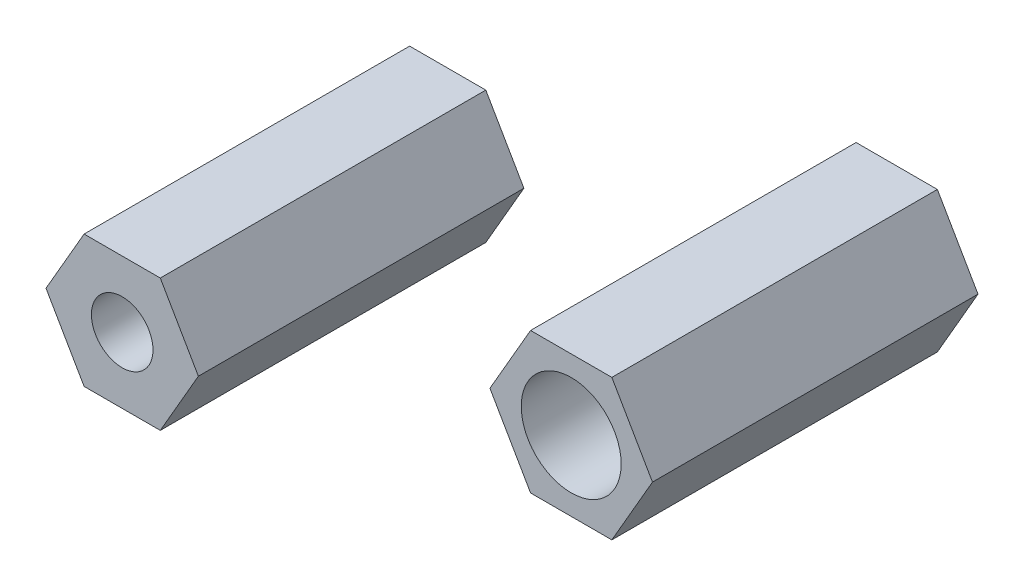
ISO-10303-21;
HEADER;
FILE_DESCRIPTION(('STEP AP214'),'2;1');
FILE_NAME('part.step','',(''),(''),'','','');
FILE_SCHEMA(('AUTOMOTIVE_DESIGN { 1 0 10303 214 1 1 1 1 }'));
ENDSEC;
DATA;
#1=APPLICATION_CONTEXT('core data for automotive mechanical design processes');
#2=APPLICATION_PROTOCOL_DEFINITION('international standard','automotive_design',2000,#1);
#3=PRODUCT_CONTEXT('',#1,'mechanical');
#4=PRODUCT('Part','Part','',(#3));
#5=PRODUCT_RELATED_PRODUCT_CATEGORY('part','',(#4));
#6=PRODUCT_DEFINITION_FORMATION('','',#4);
#7=PRODUCT_DEFINITION_CONTEXT('part definition',#1,'design');
#8=PRODUCT_DEFINITION('design','',#6,#7);
#9=PRODUCT_DEFINITION_SHAPE('','',#8);
#10=(LENGTH_UNIT() NAMED_UNIT(*) SI_UNIT(.MILLI.,.METRE.));
#11=(NAMED_UNIT(*) PLANE_ANGLE_UNIT() SI_UNIT($,.RADIAN.));
#12=(NAMED_UNIT(*) SI_UNIT($,.STERADIAN.) SOLID_ANGLE_UNIT());
#13=UNCERTAINTY_MEASURE_WITH_UNIT(LENGTH_MEASURE(1.E-05),#10,'distance_accuracy_value','');
#14=(GEOMETRIC_REPRESENTATION_CONTEXT(3) GLOBAL_UNCERTAINTY_ASSIGNED_CONTEXT((#13)) GLOBAL_UNIT_ASSIGNED_CONTEXT((#10,
#11,#12)) REPRESENTATION_CONTEXT('',''));
#15=CARTESIAN_POINT('',(0.,0.,0.));
#16=DIRECTION('',(0.,0.,1.));
#17=DIRECTION('',(1.,0.,0.));
#18=AXIS2_PLACEMENT_3D('',#15,#16,#17);
#19=CARTESIAN_POINT('',(-31.5035478936676,4.14888144856973,23.5330204590227));
#20=DIRECTION('',(0.,0.,1.));
#21=DIRECTION('',(1.,0.,0.));
#22=AXIS2_PLACEMENT_3D('',#19,#20,#21);
#23=PLANE('',#22);
#24=CARTESIAN_POINT('',(-31.5035478936676,4.14888144856973,23.5330204590227));
#25=DIRECTION('',(0.,0.,1.));
#26=DIRECTION('',(1.,0.,0.));
#27=AXIS2_PLACEMENT_3D('',#24,#25,#26);
#28=CIRCLE('',#27,3.5);
#29=CARTESIAN_POINT('',(-28.0035478936676,4.14888144856973,23.5330204590227));
#30=VERTEX_POINT('',#29);
#31=EDGE_CURVE('E12',#30,#30,#28,.F.);
#32=ORIENTED_EDGE('',*,*,#31,.F.);
#33=EDGE_LOOP('',(#32));
#34=FACE_BOUND('',#33,.T.);
#35=CARTESIAN_POINT('',(-31.5035478936676,4.14888144856973,23.5330204590227));
#36=DIRECTION('',(0.,0.,1.));
#37=DIRECTION('',(1.,0.,0.));
#38=AXIS2_PLACEMENT_3D('',#35,#36,#37);
#39=CIRCLE('',#38,2.4);
#40=CARTESIAN_POINT('',(-29.1035478936676,4.14888144856973,23.5330204590227));
#41=VERTEX_POINT('',#40);
#42=EDGE_CURVE('E135',#41,#41,#39,.T.);
#43=ORIENTED_EDGE('',*,*,#42,.F.);
#44=EDGE_LOOP('',(#43));
#45=FACE_BOUND('',#44,.T.);
#46=ADVANCED_FACE('F44',(#34,#45),#23,.T.);
#47=CARTESIAN_POINT('',(-31.5035478936676,4.14888144856973,19.5330204590227));
#48=DIRECTION('',(0.,0.,1.));
#49=DIRECTION('',(1.,0.,0.));
#50=AXIS2_PLACEMENT_3D('',#47,#48,#49);
#51=PLANE('',#50);
#52=DIRECTION('',(-0.5,-0.866025403784439,0.));
#53=VECTOR('',#52,1.);
#54=CARTESIAN_POINT('',(-35.8336749125898,11.6488814485697,19.5330204590227));
#55=LINE('',#54,#53);
#56=CARTESIAN_POINT('',(-35.8336749125898,11.6488814485697,19.5330204590227));
#57=VERTEX_POINT('',#56);
#58=CARTESIAN_POINT('',(-40.163801931512,4.14888144856973,19.5330204590227));
#59=VERTEX_POINT('',#58);
#60=EDGE_CURVE('E138',#57,#59,#55,.T.);
#61=ORIENTED_EDGE('',*,*,#60,.F.);
#62=DIRECTION('',(-1.,0.,0.));
#63=VECTOR('',#62,1.);
#64=CARTESIAN_POINT('',(-27.1734208747454,11.6488814485697,19.5330204590227));
#65=LINE('',#64,#63);
#66=CARTESIAN_POINT('',(-27.1734208747454,11.6488814485697,19.5330204590227));
#67=VERTEX_POINT('',#66);
#68=EDGE_CURVE('E59',#67,#57,#65,.T.);
#69=ORIENTED_EDGE('',*,*,#68,.F.);
#70=DIRECTION('',(-0.5,0.866025403784439,0.));
#71=VECTOR('',#70,1.);
#72=CARTESIAN_POINT('',(-22.8432938558232,4.14888144856974,19.5330204590227));
#73=LINE('',#72,#71);
#74=CARTESIAN_POINT('',(-22.8432938558232,4.14888144856974,19.5330204590227));
#75=VERTEX_POINT('',#74);
#76=EDGE_CURVE('E67',#75,#67,#73,.T.);
#77=ORIENTED_EDGE('',*,*,#76,.F.);
#78=DIRECTION('',(0.5,0.866025403784439,0.));
#79=VECTOR('',#78,1.);
#80=CARTESIAN_POINT('',(-27.1734208747454,-3.35111855143027,19.5330204590227));
#81=LINE('',#80,#79);
#82=CARTESIAN_POINT('',(-27.1734208747454,-3.35111855143027,19.5330204590227));
#83=VERTEX_POINT('',#82);
#84=EDGE_CURVE('E104',#83,#75,#81,.T.);
#85=ORIENTED_EDGE('',*,*,#84,.F.);
#86=DIRECTION('',(1.,0.,0.));
#87=VECTOR('',#86,1.);
#88=CARTESIAN_POINT('',(-35.8336749125898,-3.35111855143027,19.5330204590227));
#89=LINE('',#88,#87);
#90=CARTESIAN_POINT('',(-35.8336749125898,-3.35111855143027,19.5330204590227));
#91=VERTEX_POINT('',#90);
#92=EDGE_CURVE('E145',#91,#83,#89,.T.);
#93=ORIENTED_EDGE('',*,*,#92,.F.);
#94=DIRECTION('',(0.5,-0.866025403784439,0.));
#95=VECTOR('',#94,1.);
#96=CARTESIAN_POINT('',(-40.163801931512,4.14888144856973,19.5330204590227));
#97=LINE('',#96,#95);
#98=EDGE_CURVE('E143',#59,#91,#97,.T.);
#99=ORIENTED_EDGE('',*,*,#98,.F.);
#100=EDGE_LOOP('',(#61,#69,#77,#85,#93,#99));
#101=FACE_BOUND('',#100,.T.);
#102=CARTESIAN_POINT('',(-31.5035478936676,4.14888144856973,19.5330204590227));
#103=DIRECTION('',(0.,0.,1.));
#104=DIRECTION('',(1.,0.,0.));
#105=AXIS2_PLACEMENT_3D('',#102,#103,#104);
#106=CIRCLE('',#105,2.4);
#107=CARTESIAN_POINT('',(-29.1035478936676,4.14888144856973,19.5330204590227));
#108=VERTEX_POINT('',#107);
#109=EDGE_CURVE('E134',#108,#108,#106,.T.);
#110=ORIENTED_EDGE('',*,*,#109,.T.);
#111=EDGE_LOOP('',(#110));
#112=FACE_BOUND('',#111,.T.);
#113=ADVANCED_FACE('F164',(#101,#112),#51,.F.);
#114=CARTESIAN_POINT('',(-35.8336749125898,11.6488814485697,23.5330204590227));
#115=DIRECTION('',(0.866025403784439,-0.5,0.));
#116=DIRECTION('',(0.5,0.866025403784439,0.));
#117=AXIS2_PLACEMENT_3D('',#114,#115,#116);
#118=PLANE('',#117);
#119=ORIENTED_EDGE('',*,*,#60,.T.);
#120=DIRECTION('',(0.,0.,-1.));
#121=VECTOR('',#120,1.);
#122=CARTESIAN_POINT('',(-40.163801931512,4.14888144856973,23.5330204590227));
#123=LINE('',#122,#121);
#124=CARTESIAN_POINT('',(-40.163801931512,4.14888144856967,56.5330204590227));
#125=VERTEX_POINT('',#124);
#126=EDGE_CURVE('E52',#125,#59,#123,.T.);
#127=ORIENTED_EDGE('',*,*,#126,.F.);
#128=DIRECTION('',(-0.499999999999995,-0.866025403784442,0.));
#129=VECTOR('',#128,1.);
#130=CARTESIAN_POINT('',(-35.8336749125898,11.6488814485697,56.5330204590227));
#131=LINE('',#130,#129);
#132=CARTESIAN_POINT('',(-35.8336749125898,11.6488814485697,56.5330204590227));
#133=VERTEX_POINT('',#132);
#134=EDGE_CURVE('E128',#133,#125,#131,.T.);
#135=ORIENTED_EDGE('',*,*,#134,.F.);
#136=DIRECTION('',(0.,0.,-1.));
#137=VECTOR('',#136,1.);
#138=CARTESIAN_POINT('',(-35.8336749125898,11.6488814485697,23.5330204590227));
#139=LINE('',#138,#137);
#140=EDGE_CURVE('E150',#133,#57,#139,.T.);
#141=ORIENTED_EDGE('',*,*,#140,.T.);
#142=EDGE_LOOP('',(#119,#127,#135,#141));
#143=FACE_BOUND('',#142,.T.);
#144=ADVANCED_FACE('F46',(#143),#118,.F.);
#145=CARTESIAN_POINT('',(-40.163801931512,4.14888144856973,23.5330204590227));
#146=DIRECTION('',(0.866025403784439,0.5,0.));
#147=DIRECTION('',(-0.5,0.866025403784439,0.));
#148=AXIS2_PLACEMENT_3D('',#145,#146,#147);
#149=PLANE('',#148);
#150=ORIENTED_EDGE('',*,*,#98,.T.);
#151=DIRECTION('',(0.,0.,-1.));
#152=VECTOR('',#151,1.);
#153=CARTESIAN_POINT('',(-35.8336749125898,-3.35111855143027,23.5330204590227));
#154=LINE('',#153,#152);
#155=CARTESIAN_POINT('',(-35.8336749125897,-3.35111855143031,56.5330204590227));
#156=VERTEX_POINT('',#155);
#157=EDGE_CURVE('E154',#156,#91,#154,.T.);
#158=ORIENTED_EDGE('',*,*,#157,.F.);
#159=DIRECTION('',(0.500000000000007,-0.866025403784434,0.));
#160=VECTOR('',#159,1.);
#161=CARTESIAN_POINT('',(-40.163801931512,4.14888144856967,56.5330204590227));
#162=LINE('',#161,#160);
#163=EDGE_CURVE('E131',#125,#156,#162,.T.);
#164=ORIENTED_EDGE('',*,*,#163,.F.);
#165=ORIENTED_EDGE('',*,*,#126,.T.);
#166=EDGE_LOOP('',(#150,#158,#164,#165));
#167=FACE_BOUND('',#166,.T.);
#168=ADVANCED_FACE('F159',(#167),#149,.F.);
#169=CARTESIAN_POINT('',(-35.8336749125898,-3.35111855143027,23.5330204590227));
#170=DIRECTION('',(0.,1.,0.));
#171=DIRECTION('',(-1.,0.,0.));
#172=AXIS2_PLACEMENT_3D('',#169,#170,#171);
#173=PLANE('',#172);
#174=ORIENTED_EDGE('',*,*,#92,.T.);
#175=DIRECTION('',(0.,0.,-1.));
#176=VECTOR('',#175,1.);
#177=CARTESIAN_POINT('',(-27.1734208747454,-3.35111855143027,23.5330204590227));
#178=LINE('',#177,#176);
#179=CARTESIAN_POINT('',(-27.1734208747453,-3.35111855143022,56.5330204590227));
#180=VERTEX_POINT('',#179);
#181=EDGE_CURVE('E105',#180,#83,#178,.T.);
#182=ORIENTED_EDGE('',*,*,#181,.F.);
#183=DIRECTION('',(1.,0.,0.));
#184=VECTOR('',#183,1.);
#185=CARTESIAN_POINT('',(-35.8336749125897,-3.35111855143031,56.5330204590227));
#186=LINE('',#185,#184);
#187=EDGE_CURVE('E121',#156,#180,#186,.T.);
#188=ORIENTED_EDGE('',*,*,#187,.F.);
#189=ORIENTED_EDGE('',*,*,#157,.T.);
#190=EDGE_LOOP('',(#174,#182,#188,#189));
#191=FACE_BOUND('',#190,.T.);
#192=ADVANCED_FACE('F168',(#191),#173,.F.);
#193=CARTESIAN_POINT('',(-27.1734208747454,-3.35111855143027,23.5330204590227));
#194=DIRECTION('',(-0.866025403784439,0.5,0.));
#195=DIRECTION('',(-0.5,-0.866025403784439,0.));
#196=AXIS2_PLACEMENT_3D('',#193,#194,#195);
#197=PLANE('',#196);
#198=ORIENTED_EDGE('',*,*,#84,.T.);
#199=DIRECTION('',(0.,0.,-1.));
#200=VECTOR('',#199,1.);
#201=CARTESIAN_POINT('',(-22.8432938558232,4.14888144856974,23.5330204590227));
#202=LINE('',#201,#200);
#203=CARTESIAN_POINT('',(-22.8432938558232,4.14888144856974,56.5330204590227));
#204=VERTEX_POINT('',#203);
#205=EDGE_CURVE('E97',#204,#75,#202,.T.);
#206=ORIENTED_EDGE('',*,*,#205,.F.);
#207=DIRECTION('',(0.499999999999995,0.866025403784442,0.));
#208=VECTOR('',#207,1.);
#209=CARTESIAN_POINT('',(-27.1734208747453,-3.35111855143022,56.5330204590227));
#210=LINE('',#209,#208);
#211=EDGE_CURVE('E102',#180,#204,#210,.T.);
#212=ORIENTED_EDGE('',*,*,#211,.F.);
#213=ORIENTED_EDGE('',*,*,#181,.T.);
#214=EDGE_LOOP('',(#198,#206,#212,#213));
#215=FACE_BOUND('',#214,.T.);
#216=ADVANCED_FACE('F99',(#215),#197,.F.);
#217=CARTESIAN_POINT('',(-22.8432938558232,4.14888144856974,23.5330204590227));
#218=DIRECTION('',(-0.866025403784439,-0.5,0.));
#219=DIRECTION('',(0.5,-0.866025403784439,0.));
#220=AXIS2_PLACEMENT_3D('',#217,#218,#219);
#221=PLANE('',#220);
#222=ORIENTED_EDGE('',*,*,#76,.T.);
#223=DIRECTION('',(0.,0.,-1.));
#224=VECTOR('',#223,1.);
#225=CARTESIAN_POINT('',(-27.1734208747454,11.6488814485697,23.5330204590227));
#226=LINE('',#225,#224);
#227=CARTESIAN_POINT('',(-27.1734208747454,11.6488814485697,56.5330204590227));
#228=VERTEX_POINT('',#227);
#229=EDGE_CURVE('E106',#228,#67,#226,.T.);
#230=ORIENTED_EDGE('',*,*,#229,.F.);
#231=DIRECTION('',(-0.500000000000001,0.866025403784438,0.));
#232=VECTOR('',#231,1.);
#233=CARTESIAN_POINT('',(-22.8432938558232,4.14888144856974,56.5330204590227));
#234=LINE('',#233,#232);
#235=EDGE_CURVE('E109',#204,#228,#234,.T.);
#236=ORIENTED_EDGE('',*,*,#235,.F.);
#237=ORIENTED_EDGE('',*,*,#205,.T.);
#238=EDGE_LOOP('',(#222,#230,#236,#237));
#239=FACE_BOUND('',#238,.T.);
#240=ADVANCED_FACE('F110',(#239),#221,.F.);
#241=CARTESIAN_POINT('',(-27.1734208747454,11.6488814485697,23.5330204590227));
#242=DIRECTION('',(0.,-1.,0.));
#243=DIRECTION('',(0.,0.,-1.));
#244=AXIS2_PLACEMENT_3D('',#241,#242,#243);
#245=PLANE('',#244);
#246=ORIENTED_EDGE('',*,*,#68,.T.);
#247=ORIENTED_EDGE('',*,*,#140,.F.);
#248=DIRECTION('',(-1.,0.,0.));
#249=VECTOR('',#248,1.);
#250=CARTESIAN_POINT('',(-27.1734208747454,11.6488814485697,56.5330204590227));
#251=LINE('',#250,#249);
#252=EDGE_CURVE('E114',#228,#133,#251,.T.);
#253=ORIENTED_EDGE('',*,*,#252,.F.);
#254=ORIENTED_EDGE('',*,*,#229,.T.);
#255=EDGE_LOOP('',(#246,#247,#253,#254));
#256=FACE_BOUND('',#255,.T.);
#257=ADVANCED_FACE('F169',(#256),#245,.F.);
#258=CARTESIAN_POINT('',(-31.5035478936676,4.14888144856973,23.5330204590227));
#259=DIRECTION('',(0.,0.,-1.));
#260=DIRECTION('',(-1.,0.,0.));
#261=AXIS2_PLACEMENT_3D('',#258,#259,#260);
#262=CYLINDRICAL_SURFACE('',#261,2.4);
#263=ORIENTED_EDGE('',*,*,#42,.T.);
#264=EDGE_LOOP('',(#263));
#265=FACE_BOUND('',#264,.T.);
#266=ORIENTED_EDGE('',*,*,#109,.F.);
#267=EDGE_LOOP('',(#266));
#268=FACE_BOUND('',#267,.T.);
#269=ADVANCED_FACE('F171',(#265,#268),#262,.F.);
#270=CARTESIAN_POINT('',(-31.5035478936676,4.14888144856973,56.5330204590227));
#271=DIRECTION('',(0.,0.,1.));
#272=DIRECTION('',(1.,0.,0.));
#273=AXIS2_PLACEMENT_3D('',#270,#271,#272);
#274=PLANE('',#273);
#275=ORIENTED_EDGE('',*,*,#211,.T.);
#276=ORIENTED_EDGE('',*,*,#235,.T.);
#277=ORIENTED_EDGE('',*,*,#252,.T.);
#278=ORIENTED_EDGE('',*,*,#134,.T.);
#279=ORIENTED_EDGE('',*,*,#163,.T.);
#280=ORIENTED_EDGE('',*,*,#187,.T.);
#281=EDGE_LOOP('',(#275,#276,#277,#278,#279,#280));
#282=FACE_BOUND('',#281,.T.);
#283=CARTESIAN_POINT('',(-31.5035478936676,4.14888144856973,56.5330204590227));
#284=DIRECTION('',(0.,0.,1.));
#285=DIRECTION('',(1.,0.,0.));
#286=AXIS2_PLACEMENT_3D('',#283,#284,#285);
#287=CIRCLE('',#286,3.5);
#288=CARTESIAN_POINT('',(-28.0035478936676,4.14888144856973,56.5330204590227));
#289=VERTEX_POINT('',#288);
#290=EDGE_CURVE('E122',#289,#289,#287,.T.);
#291=ORIENTED_EDGE('',*,*,#290,.F.);
#292=EDGE_LOOP('',(#291));
#293=FACE_BOUND('',#292,.T.);
#294=ADVANCED_FACE('F117',(#282,#293),#274,.T.);
#295=CARTESIAN_POINT('',(-31.5035478936676,4.14888144856973,56.5330204590227));
#296=DIRECTION('',(0.,0.,-1.));
#297=DIRECTION('',(-1.,0.,0.));
#298=AXIS2_PLACEMENT_3D('',#295,#296,#297);
#299=CYLINDRICAL_SURFACE('',#298,3.5);
#300=ORIENTED_EDGE('',*,*,#290,.T.);
#301=EDGE_LOOP('',(#300));
#302=FACE_BOUND('',#301,.T.);
#303=ORIENTED_EDGE('',*,*,#31,.T.);
#304=EDGE_LOOP('',(#303));
#305=FACE_BOUND('',#304,.T.);
#306=ADVANCED_FACE('F192',(#302,#305),#299,.F.);
#307=CLOSED_SHELL('',(#46,#113,#144,#168,#192,#216,#240,#257,#269,#294,#306));
#308=MANIFOLD_SOLID_BREP('B2',#307);
#309=CARTESIAN_POINT('',(0.,0.,4.));
#310=DIRECTION('',(0.,0.,1.));
#311=DIRECTION('',(1.,0.,0.));
#312=AXIS2_PLACEMENT_3D('',#309,#310,#311);
#313=PLANE('',#312);
#314=CARTESIAN_POINT('',(0.,0.,4.));
#315=DIRECTION('',(0.,0.,1.));
#316=DIRECTION('',(1.,0.,0.));
#317=AXIS2_PLACEMENT_3D('',#314,#315,#316);
#318=CIRCLE('',#317,5.67875156277063);
#319=CARTESIAN_POINT('',(5.67875156277063,0.,4.));
#320=VERTEX_POINT('',#319);
#321=EDGE_CURVE('E42',#320,#320,#318,.F.);
#322=ORIENTED_EDGE('',*,*,#321,.F.);
#323=EDGE_LOOP('',(#322));
#324=FACE_BOUND('',#323,.T.);
#325=CARTESIAN_POINT('',(0.,0.,4.));
#326=DIRECTION('',(0.,0.,1.));
#327=DIRECTION('',(1.,0.,0.));
#328=AXIS2_PLACEMENT_3D('',#325,#326,#327);
#329=CIRCLE('',#328,2.4);
#330=CARTESIAN_POINT('',(2.4,0.,4.));
#331=VERTEX_POINT('',#330);
#332=EDGE_CURVE('E378',#331,#331,#329,.T.);
#333=ORIENTED_EDGE('',*,*,#332,.F.);
#334=EDGE_LOOP('',(#333));
#335=FACE_BOUND('',#334,.T.);
#336=ADVANCED_FACE('F288',(#324,#335),#313,.T.);
#337=CARTESIAN_POINT('',(0.,0.,0.));
#338=DIRECTION('',(0.,0.,1.));
#339=DIRECTION('',(1.,0.,0.));
#340=AXIS2_PLACEMENT_3D('',#337,#338,#339);
#341=PLANE('',#340);
#342=DIRECTION('',(0.5,0.866025403784439,0.));
#343=VECTOR('',#342,1.);
#344=CARTESIAN_POINT('',(4.61880215351701,-8.00000000000001,0.));
#345=LINE('',#344,#343);
#346=CARTESIAN_POINT('',(4.61880215351701,-8.00000000000001,0.));
#347=VERTEX_POINT('',#346);
#348=CARTESIAN_POINT('',(9.23760430703402,0.,0.));
#349=VERTEX_POINT('',#348);
#350=EDGE_CURVE('E347',#347,#349,#345,.T.);
#351=ORIENTED_EDGE('',*,*,#350,.F.);
#352=DIRECTION('',(1.,0.,0.));
#353=VECTOR('',#352,1.);
#354=CARTESIAN_POINT('',(-4.61880215351701,-8.00000000000001,0.));
#355=LINE('',#354,#353);
#356=CARTESIAN_POINT('',(-4.61880215351701,-8.00000000000001,0.));
#357=VERTEX_POINT('',#356);
#358=EDGE_CURVE('E303',#357,#347,#355,.T.);
#359=ORIENTED_EDGE('',*,*,#358,.F.);
#360=DIRECTION('',(0.5,-0.866025403784439,0.));
#361=VECTOR('',#360,1.);
#362=CARTESIAN_POINT('',(-9.23760430703402,0.,0.));
#363=LINE('',#362,#361);
#364=CARTESIAN_POINT('',(-9.23760430703402,0.,0.));
#365=VERTEX_POINT('',#364);
#366=EDGE_CURVE('E311',#365,#357,#363,.T.);
#367=ORIENTED_EDGE('',*,*,#366,.F.);
#368=DIRECTION('',(-0.5,-0.866025403784439,0.));
#369=VECTOR('',#368,1.);
#370=CARTESIAN_POINT('',(-4.61880215351701,8.00000000000001,0.));
#371=LINE('',#370,#369);
#372=CARTESIAN_POINT('',(-4.61880215351701,8.00000000000001,0.));
#373=VERTEX_POINT('',#372);
#374=EDGE_CURVE('E388',#373,#365,#371,.T.);
#375=ORIENTED_EDGE('',*,*,#374,.F.);
#376=DIRECTION('',(-1.,0.,0.));
#377=VECTOR('',#376,1.);
#378=CARTESIAN_POINT('',(4.61880215351701,8.00000000000001,0.));
#379=LINE('',#378,#377);
#380=CARTESIAN_POINT('',(4.61880215351701,8.00000000000001,0.));
#381=VERTEX_POINT('',#380);
#382=EDGE_CURVE('E386',#381,#373,#379,.T.);
#383=ORIENTED_EDGE('',*,*,#382,.F.);
#384=DIRECTION('',(-0.5,0.866025403784439,0.));
#385=VECTOR('',#384,1.);
#386=CARTESIAN_POINT('',(9.23760430703402,0.,0.));
#387=LINE('',#386,#385);
#388=EDGE_CURVE('E384',#349,#381,#387,.T.);
#389=ORIENTED_EDGE('',*,*,#388,.F.);
#390=EDGE_LOOP('',(#351,#359,#367,#375,#383,#389));
#391=FACE_BOUND('',#390,.T.);
#392=CARTESIAN_POINT('',(0.,0.,0.));
#393=DIRECTION('',(0.,0.,1.));
#394=DIRECTION('',(1.,0.,0.));
#395=AXIS2_PLACEMENT_3D('',#392,#393,#394);
#396=CIRCLE('',#395,2.4);
#397=CARTESIAN_POINT('',(2.4,0.,0.));
#398=VERTEX_POINT('',#397);
#399=EDGE_CURVE('E377',#398,#398,#396,.T.);
#400=ORIENTED_EDGE('',*,*,#399,.T.);
#401=EDGE_LOOP('',(#400));
#402=FACE_BOUND('',#401,.T.);
#403=ADVANCED_FACE('F406',(#391,#402),#341,.F.);
#404=CARTESIAN_POINT('',(4.61880215351701,-8.00000000000001,4.));
#405=DIRECTION('',(-0.866025403784439,0.5,0.));
#406=DIRECTION('',(-0.5,-0.866025403784439,0.));
#407=AXIS2_PLACEMENT_3D('',#404,#405,#406);
#408=PLANE('',#407);
#409=ORIENTED_EDGE('',*,*,#350,.T.);
#410=DIRECTION('',(0.,0.,-1.));
#411=VECTOR('',#410,1.);
#412=CARTESIAN_POINT('',(9.23760430703402,0.,4.));
#413=LINE('',#412,#411);
#414=CARTESIAN_POINT('',(9.23760430703402,0.,37.));
#415=VERTEX_POINT('',#414);
#416=EDGE_CURVE('E296',#415,#349,#413,.T.);
#417=ORIENTED_EDGE('',*,*,#416,.F.);
#418=DIRECTION('',(0.499999999999995,0.866025403784442,0.));
#419=VECTOR('',#418,1.);
#420=CARTESIAN_POINT('',(4.6188021535171,-7.99999999999995,37.));
#421=LINE('',#420,#419);
#422=CARTESIAN_POINT('',(4.6188021535171,-7.99999999999995,37.));
#423=VERTEX_POINT('',#422);
#424=EDGE_CURVE('E345',#423,#415,#421,.T.);
#425=ORIENTED_EDGE('',*,*,#424,.F.);
#426=DIRECTION('',(0.,0.,-1.));
#427=VECTOR('',#426,1.);
#428=CARTESIAN_POINT('',(4.61880215351701,-8.00000000000001,4.));
#429=LINE('',#428,#427);
#430=EDGE_CURVE('E392',#423,#347,#429,.T.);
#431=ORIENTED_EDGE('',*,*,#430,.T.);
#432=EDGE_LOOP('',(#409,#417,#425,#431));
#433=FACE_BOUND('',#432,.T.);
#434=ADVANCED_FACE('F290',(#433),#408,.F.);
#435=CARTESIAN_POINT('',(9.23760430703402,0.,4.));
#436=DIRECTION('',(-0.866025403784439,-0.5,0.));
#437=DIRECTION('',(0.5,-0.866025403784439,0.));
#438=AXIS2_PLACEMENT_3D('',#435,#436,#437);
#439=PLANE('',#438);
#440=ORIENTED_EDGE('',*,*,#388,.T.);
#441=DIRECTION('',(0.,0.,-1.));
#442=VECTOR('',#441,1.);
#443=CARTESIAN_POINT('',(4.61880215351701,8.00000000000001,4.));
#444=LINE('',#443,#442);
#445=CARTESIAN_POINT('',(4.61880215351699,8.00000000000002,37.));
#446=VERTEX_POINT('',#445);
#447=EDGE_CURVE('E349',#446,#381,#444,.T.);
#448=ORIENTED_EDGE('',*,*,#447,.F.);
#449=DIRECTION('',(-0.500000000000001,0.866025403784438,0.));
#450=VECTOR('',#449,1.);
#451=CARTESIAN_POINT('',(9.23760430703402,0.,37.));
#452=LINE('',#451,#450);
#453=EDGE_CURVE('E351',#415,#446,#452,.T.);
#454=ORIENTED_EDGE('',*,*,#453,.F.);
#455=ORIENTED_EDGE('',*,*,#416,.T.);
#456=EDGE_LOOP('',(#440,#448,#454,#455));
#457=FACE_BOUND('',#456,.T.);
#458=ADVANCED_FACE('F352',(#457),#439,.F.);
#459=CARTESIAN_POINT('',(4.61880215351701,8.00000000000001,4.));
#460=DIRECTION('',(0.,-1.,0.));
#461=DIRECTION('',(1.,0.,0.));
#462=AXIS2_PLACEMENT_3D('',#459,#460,#461);
#463=PLANE('',#462);
#464=ORIENTED_EDGE('',*,*,#382,.T.);
#465=DIRECTION('',(0.,0.,-1.));
#466=VECTOR('',#465,1.);
#467=CARTESIAN_POINT('',(-4.61880215351701,8.00000000000001,4.));
#468=LINE('',#467,#466);
#469=CARTESIAN_POINT('',(-4.61880215351705,7.99999999999998,37.));
#470=VERTEX_POINT('',#469);
#471=EDGE_CURVE('E398',#470,#373,#468,.T.);
#472=ORIENTED_EDGE('',*,*,#471,.F.);
#473=DIRECTION('',(-1.,0.,0.));
#474=VECTOR('',#473,1.);
#475=CARTESIAN_POINT('',(4.61880215351699,8.00000000000002,37.));
#476=LINE('',#475,#474);
#477=EDGE_CURVE('E357',#446,#470,#476,.T.);
#478=ORIENTED_EDGE('',*,*,#477,.F.);
#479=ORIENTED_EDGE('',*,*,#447,.T.);
#480=EDGE_LOOP('',(#464,#472,#478,#479));
#481=FACE_BOUND('',#480,.T.);
#482=ADVANCED_FACE('F403',(#481),#463,.F.);
#483=CARTESIAN_POINT('',(-4.61880215351701,8.00000000000001,4.));
#484=DIRECTION('',(0.866025403784439,-0.5,0.));
#485=DIRECTION('',(0.5,0.866025403784439,0.));
#486=AXIS2_PLACEMENT_3D('',#483,#484,#485);
#487=PLANE('',#486);
#488=ORIENTED_EDGE('',*,*,#374,.T.);
#489=DIRECTION('',(0.,0.,-1.));
#490=VECTOR('',#489,1.);
#491=CARTESIAN_POINT('',(-9.23760430703402,0.,4.));
#492=LINE('',#491,#490);
#493=CARTESIAN_POINT('',(-9.23760430703402,0.,37.));
#494=VERTEX_POINT('',#493);
#495=EDGE_CURVE('E396',#494,#365,#492,.T.);
#496=ORIENTED_EDGE('',*,*,#495,.F.);
#497=DIRECTION('',(-0.499999999999995,-0.866025403784441,0.));
#498=VECTOR('',#497,1.);
#499=CARTESIAN_POINT('',(-4.61880215351705,7.99999999999998,37.));
#500=LINE('',#499,#498);
#501=EDGE_CURVE('E371',#470,#494,#500,.T.);
#502=ORIENTED_EDGE('',*,*,#501,.F.);
#503=ORIENTED_EDGE('',*,*,#471,.T.);
#504=EDGE_LOOP('',(#488,#496,#502,#503));
#505=FACE_BOUND('',#504,.T.);
#506=ADVANCED_FACE('F409',(#505),#487,.F.);
#507=CARTESIAN_POINT('',(-9.23760430703402,0.,4.));
#508=DIRECTION('',(0.866025403784439,0.5,0.));
#509=DIRECTION('',(-0.5,0.866025403784439,0.));
#510=AXIS2_PLACEMENT_3D('',#507,#508,#509);
#511=PLANE('',#510);
#512=ORIENTED_EDGE('',*,*,#366,.T.);
#513=DIRECTION('',(0.,0.,-1.));
#514=VECTOR('',#513,1.);
#515=CARTESIAN_POINT('',(-4.61880215351701,-8.00000000000001,4.));
#516=LINE('',#515,#514);
#517=CARTESIAN_POINT('',(-4.61880215351693,-8.00000000000005,37.));
#518=VERTEX_POINT('',#517);
#519=EDGE_CURVE('E394',#518,#357,#516,.T.);
#520=ORIENTED_EDGE('',*,*,#519,.F.);
#521=DIRECTION('',(0.500000000000007,-0.866025403784435,0.));
#522=VECTOR('',#521,1.);
#523=CARTESIAN_POINT('',(-9.23760430703402,0.,37.));
#524=LINE('',#523,#522);
#525=EDGE_CURVE('E374',#494,#518,#524,.T.);
#526=ORIENTED_EDGE('',*,*,#525,.F.);
#527=ORIENTED_EDGE('',*,*,#495,.T.);
#528=EDGE_LOOP('',(#512,#520,#526,#527));
#529=FACE_BOUND('',#528,.T.);
#530=ADVANCED_FACE('F412',(#529),#511,.F.);
#531=CARTESIAN_POINT('',(-4.61880215351701,-8.00000000000001,4.));
#532=DIRECTION('',(0.,1.,0.));
#533=DIRECTION('',(-1.,0.,0.));
#534=AXIS2_PLACEMENT_3D('',#531,#532,#533);
#535=PLANE('',#534);
#536=ORIENTED_EDGE('',*,*,#358,.T.);
#537=ORIENTED_EDGE('',*,*,#430,.F.);
#538=DIRECTION('',(1.,0.,0.));
#539=VECTOR('',#538,1.);
#540=CARTESIAN_POINT('',(-4.61880215351693,-8.00000000000005,37.));
#541=LINE('',#540,#539);
#542=EDGE_CURVE('E364',#518,#423,#541,.T.);
#543=ORIENTED_EDGE('',*,*,#542,.F.);
#544=ORIENTED_EDGE('',*,*,#519,.T.);
#545=EDGE_LOOP('',(#536,#537,#543,#544));
#546=FACE_BOUND('',#545,.T.);
#547=ADVANCED_FACE('F413',(#546),#535,.F.);
#548=CARTESIAN_POINT('',(0.,0.,4.));
#549=DIRECTION('',(0.,0.,-1.));
#550=DIRECTION('',(-1.,0.,0.));
#551=AXIS2_PLACEMENT_3D('',#548,#549,#550);
#552=CYLINDRICAL_SURFACE('',#551,2.4);
#553=ORIENTED_EDGE('',*,*,#332,.T.);
#554=EDGE_LOOP('',(#553));
#555=FACE_BOUND('',#554,.T.);
#556=ORIENTED_EDGE('',*,*,#399,.F.);
#557=EDGE_LOOP('',(#556));
#558=FACE_BOUND('',#557,.T.);
#559=ADVANCED_FACE('F415',(#555,#558),#552,.F.);
#560=CARTESIAN_POINT('',(0.,0.,37.));
#561=DIRECTION('',(0.,0.,1.));
#562=DIRECTION('',(1.,0.,0.));
#563=AXIS2_PLACEMENT_3D('',#560,#561,#562);
#564=PLANE('',#563);
#565=ORIENTED_EDGE('',*,*,#424,.T.);
#566=ORIENTED_EDGE('',*,*,#453,.T.);
#567=ORIENTED_EDGE('',*,*,#477,.T.);
#568=ORIENTED_EDGE('',*,*,#501,.T.);
#569=ORIENTED_EDGE('',*,*,#525,.T.);
#570=ORIENTED_EDGE('',*,*,#542,.T.);
#571=EDGE_LOOP('',(#565,#566,#567,#568,#569,#570));
#572=FACE_BOUND('',#571,.T.);
#573=CARTESIAN_POINT('',(0.,0.,37.));
#574=DIRECTION('',(0.,0.,1.));
#575=DIRECTION('',(1.,0.,0.));
#576=AXIS2_PLACEMENT_3D('',#573,#574,#575);
#577=CIRCLE('',#576,5.67875156277063);
#578=CARTESIAN_POINT('',(5.67875156277063,0.,37.));
#579=VERTEX_POINT('',#578);
#580=EDGE_CURVE('E365',#579,#579,#577,.T.);
#581=ORIENTED_EDGE('',*,*,#580,.F.);
#582=EDGE_LOOP('',(#581));
#583=FACE_BOUND('',#582,.T.);
#584=ADVANCED_FACE('F360',(#572,#583),#564,.T.);
#585=CARTESIAN_POINT('',(0.,0.,37.));
#586=DIRECTION('',(0.,0.,-1.));
#587=DIRECTION('',(-1.,0.,0.));
#588=AXIS2_PLACEMENT_3D('',#585,#586,#587);
#589=CYLINDRICAL_SURFACE('',#588,5.67875156277063);
#590=ORIENTED_EDGE('',*,*,#580,.T.);
#591=EDGE_LOOP('',(#590));
#592=FACE_BOUND('',#591,.T.);
#593=ORIENTED_EDGE('',*,*,#321,.T.);
#594=EDGE_LOOP('',(#593));
#595=FACE_BOUND('',#594,.T.);
#596=ADVANCED_FACE('F436',(#592,#595),#589,.F.);
#597=CLOSED_SHELL('',(#336,#403,#434,#458,#482,#506,#530,#547,#559,#584,#596));
#598=MANIFOLD_SOLID_BREP('B6',#597);
#599=ADVANCED_BREP_SHAPE_REPRESENTATION('',(#18,#308,#598),#14);
#600=SHAPE_DEFINITION_REPRESENTATION(#9,#599);
ENDSEC;
END-ISO-10303-21;
